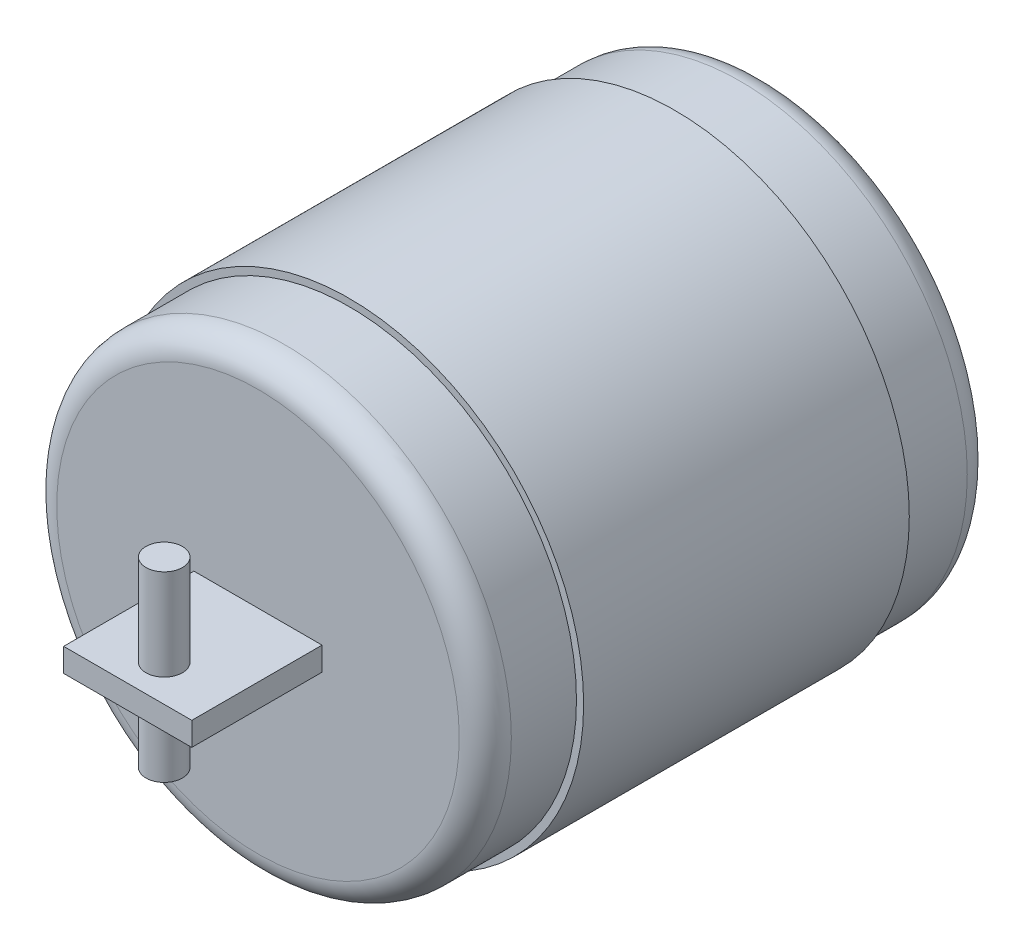
ISO-10303-21;
HEADER;
FILE_DESCRIPTION(('STEP AP214'),'2;1');
FILE_NAME('part.step','',(''),(''),'','','');
FILE_SCHEMA(('AUTOMOTIVE_DESIGN { 1 0 10303 214 1 1 1 1 }'));
ENDSEC;
DATA;
#1=APPLICATION_CONTEXT('core data for automotive mechanical design processes');
#2=APPLICATION_PROTOCOL_DEFINITION('international standard','automotive_design',2000,#1);
#3=PRODUCT_CONTEXT('',#1,'mechanical');
#4=PRODUCT('Part','Part','',(#3));
#5=PRODUCT_RELATED_PRODUCT_CATEGORY('part','',(#4));
#6=PRODUCT_DEFINITION_FORMATION('','',#4);
#7=PRODUCT_DEFINITION_CONTEXT('part definition',#1,'design');
#8=PRODUCT_DEFINITION('design','',#6,#7);
#9=PRODUCT_DEFINITION_SHAPE('','',#8);
#10=(LENGTH_UNIT() NAMED_UNIT(*) SI_UNIT(.MILLI.,.METRE.));
#11=(NAMED_UNIT(*) PLANE_ANGLE_UNIT() SI_UNIT($,.RADIAN.));
#12=(NAMED_UNIT(*) SI_UNIT($,.STERADIAN.) SOLID_ANGLE_UNIT());
#13=UNCERTAINTY_MEASURE_WITH_UNIT(LENGTH_MEASURE(1.E-05),#10,'distance_accuracy_value','');
#14=(GEOMETRIC_REPRESENTATION_CONTEXT(3) GLOBAL_UNCERTAINTY_ASSIGNED_CONTEXT((#13)) GLOBAL_UNIT_ASSIGNED_CONTEXT((#10,
#11,#12)) REPRESENTATION_CONTEXT('',''));
#15=CARTESIAN_POINT('',(0.,0.,0.));
#16=DIRECTION('',(0.,0.,1.));
#17=DIRECTION('',(1.,0.,0.));
#18=AXIS2_PLACEMENT_3D('',#15,#16,#17);
#19=CARTESIAN_POINT('',(0.,0.,25.));
#20=DIRECTION('',(0.,0.,-1.));
#21=DIRECTION('',(-1.,0.,0.));
#22=AXIS2_PLACEMENT_3D('',#19,#20,#21);
#23=CYLINDRICAL_SURFACE('',#22,18.);
#24=CARTESIAN_POINT('',(0.,0.,25.));
#25=DIRECTION('',(0.,0.,1.));
#26=DIRECTION('',(1.,0.,0.));
#27=AXIS2_PLACEMENT_3D('',#24,#25,#26);
#28=CIRCLE('',#27,18.);
#29=CARTESIAN_POINT('',(18.,0.,25.));
#30=VERTEX_POINT('',#29);
#31=EDGE_CURVE('E146',#30,#30,#28,.T.);
#32=ORIENTED_EDGE('',*,*,#31,.F.);
#33=EDGE_LOOP('',(#32));
#34=FACE_BOUND('',#33,.T.);
#35=CARTESIAN_POINT('',(0.,0.,0.));
#36=DIRECTION('',(0.,0.,1.));
#37=DIRECTION('',(1.,0.,0.));
#38=AXIS2_PLACEMENT_3D('',#35,#36,#37);
#39=CIRCLE('',#38,18.);
#40=CARTESIAN_POINT('',(18.,0.,0.));
#41=VERTEX_POINT('',#40);
#42=EDGE_CURVE('E140',#41,#41,#39,.T.);
#43=ORIENTED_EDGE('',*,*,#42,.T.);
#44=EDGE_LOOP('',(#43));
#45=FACE_BOUND('',#44,.T.);
#46=ADVANCED_FACE('F43',(#34,#45),#23,.T.);
#47=CARTESIAN_POINT('',(0.,0.,25.));
#48=DIRECTION('',(0.,0.,1.));
#49=DIRECTION('',(1.,0.,0.));
#50=AXIS2_PLACEMENT_3D('',#47,#48,#49);
#51=PLANE('',#50);
#52=CARTESIAN_POINT('',(0.,0.,25.));
#53=DIRECTION('',(0.,0.,1.));
#54=DIRECTION('',(1.,0.,0.));
#55=AXIS2_PLACEMENT_3D('',#52,#53,#54);
#56=CIRCLE('',#55,17.45);
#57=CARTESIAN_POINT('',(17.45,0.,25.));
#58=VERTEX_POINT('',#57);
#59=EDGE_CURVE('E141',#58,#58,#56,.T.);
#60=ORIENTED_EDGE('',*,*,#59,.F.);
#61=EDGE_LOOP('',(#60));
#62=FACE_BOUND('',#61,.T.);
#63=ORIENTED_EDGE('',*,*,#31,.T.);
#64=EDGE_LOOP('',(#63));
#65=FACE_BOUND('',#64,.T.);
#66=ADVANCED_FACE('F186',(#62,#65),#51,.T.);
#67=CARTESIAN_POINT('',(0.,0.,0.));
#68=DIRECTION('',(0.,0.,1.));
#69=DIRECTION('',(1.,0.,0.));
#70=AXIS2_PLACEMENT_3D('',#67,#68,#69);
#71=PLANE('',#70);
#72=CARTESIAN_POINT('',(0.,0.,0.));
#73=DIRECTION('',(0.,0.,1.));
#74=DIRECTION('',(1.,0.,0.));
#75=AXIS2_PLACEMENT_3D('',#72,#73,#74);
#76=CIRCLE('',#75,17.45);
#77=CARTESIAN_POINT('',(17.45,0.,0.));
#78=VERTEX_POINT('',#77);
#79=EDGE_CURVE('E136',#78,#78,#76,.T.);
#80=ORIENTED_EDGE('',*,*,#79,.T.);
#81=EDGE_LOOP('',(#80));
#82=FACE_BOUND('',#81,.T.);
#83=ORIENTED_EDGE('',*,*,#42,.F.);
#84=EDGE_LOOP('',(#83));
#85=FACE_BOUND('',#84,.T.);
#86=ADVANCED_FACE('F182',(#82,#85),#71,.F.);
#87=CARTESIAN_POINT('',(0.,0.,32.));
#88=DIRECTION('',(0.,0.,-1.));
#89=DIRECTION('',(-1.,0.,0.));
#90=AXIS2_PLACEMENT_3D('',#87,#88,#89);
#91=CYLINDRICAL_SURFACE('',#90,17.45);
#92=CARTESIAN_POINT('',(0.,0.,30.));
#93=DIRECTION('',(0.,0.,1.));
#94=DIRECTION('',(1.,0.,0.));
#95=AXIS2_PLACEMENT_3D('',#92,#93,#94);
#96=CIRCLE('',#95,17.45);
#97=CARTESIAN_POINT('',(17.45,0.,30.));
#98=VERTEX_POINT('',#97);
#99=EDGE_CURVE('E156',#98,#98,#96,.F.);
#100=ORIENTED_EDGE('',*,*,#99,.T.);
#101=EDGE_LOOP('',(#100));
#102=FACE_BOUND('',#101,.T.);
#103=ORIENTED_EDGE('',*,*,#59,.T.);
#104=EDGE_LOOP('',(#103));
#105=FACE_BOUND('',#104,.T.);
#106=ADVANCED_FACE('F185',(#102,#105),#91,.T.);
#107=CARTESIAN_POINT('',(0.,0.,32.));
#108=DIRECTION('',(0.,0.,1.));
#109=DIRECTION('',(1.,0.,0.));
#110=AXIS2_PLACEMENT_3D('',#107,#108,#109);
#111=PLANE('',#110);
#112=DIRECTION('',(0.,-1.,0.));
#113=VECTOR('',#112,1.);
#114=CARTESIAN_POINT('',(4.91823575051056,0.,32.));
#115=LINE('',#114,#113);
#116=CARTESIAN_POINT('',(4.91823575051056,0.900531566575984,32.));
#117=VERTEX_POINT('',#116);
#118=CARTESIAN_POINT('',(4.91823575051056,-0.900531566575984,32.));
#119=VERTEX_POINT('',#118);
#120=EDGE_CURVE('E119',#117,#119,#115,.T.);
#121=ORIENTED_EDGE('',*,*,#120,.T.);
#122=DIRECTION('',(1.,0.,0.));
#123=VECTOR('',#122,1.);
#124=CARTESIAN_POINT('',(0.,-0.900531566575984,32.));
#125=LINE('',#124,#123);
#126=CARTESIAN_POINT('',(-4.91823575051056,-0.900531566575984,32.));
#127=VERTEX_POINT('',#126);
#128=EDGE_CURVE('E114',#127,#119,#125,.T.);
#129=ORIENTED_EDGE('',*,*,#128,.F.);
#130=DIRECTION('',(0.,-1.,0.));
#131=VECTOR('',#130,1.);
#132=CARTESIAN_POINT('',(-4.91823575051056,0.,32.));
#133=LINE('',#132,#131);
#134=CARTESIAN_POINT('',(-4.91823575051056,0.900531566575984,32.));
#135=VERTEX_POINT('',#134);
#136=EDGE_CURVE('E125',#135,#127,#133,.T.);
#137=ORIENTED_EDGE('',*,*,#136,.F.);
#138=DIRECTION('',(1.,0.,0.));
#139=VECTOR('',#138,1.);
#140=CARTESIAN_POINT('',(0.,0.900531566575984,32.));
#141=LINE('',#140,#139);
#142=EDGE_CURVE('E100',#135,#117,#141,.T.);
#143=ORIENTED_EDGE('',*,*,#142,.T.);
#144=EDGE_LOOP('',(#121,#129,#137,#143));
#145=FACE_BOUND('',#144,.T.);
#146=CARTESIAN_POINT('',(0.,0.,32.));
#147=DIRECTION('',(0.,0.,1.));
#148=DIRECTION('',(1.,0.,0.));
#149=AXIS2_PLACEMENT_3D('',#146,#147,#148);
#150=CIRCLE('',#149,15.45);
#151=CARTESIAN_POINT('',(15.45,0.,32.));
#152=VERTEX_POINT('',#151);
#153=EDGE_CURVE('E145',#152,#152,#150,.T.);
#154=ORIENTED_EDGE('',*,*,#153,.T.);
#155=EDGE_LOOP('',(#154));
#156=FACE_BOUND('',#155,.T.);
#157=ADVANCED_FACE('F178',(#145,#156),#111,.T.);
#158=CARTESIAN_POINT('',(0.,0.,-7.));
#159=DIRECTION('',(0.,0.,1.));
#160=DIRECTION('',(1.,0.,0.));
#161=AXIS2_PLACEMENT_3D('',#158,#159,#160);
#162=CYLINDRICAL_SURFACE('',#161,17.45);
#163=CARTESIAN_POINT('',(0.,0.,-5.));
#164=DIRECTION('',(0.,0.,1.));
#165=DIRECTION('',(1.,0.,0.));
#166=AXIS2_PLACEMENT_3D('',#163,#164,#165);
#167=CIRCLE('',#166,17.45);
#168=CARTESIAN_POINT('',(17.45,0.,-5.));
#169=VERTEX_POINT('',#168);
#170=EDGE_CURVE('E160',#169,#169,#167,.T.);
#171=ORIENTED_EDGE('',*,*,#170,.T.);
#172=EDGE_LOOP('',(#171));
#173=FACE_BOUND('',#172,.T.);
#174=ORIENTED_EDGE('',*,*,#79,.F.);
#175=EDGE_LOOP('',(#174));
#176=FACE_BOUND('',#175,.T.);
#177=ADVANCED_FACE('F175',(#173,#176),#162,.T.);
#178=CARTESIAN_POINT('',(0.,0.,-7.));
#179=DIRECTION('',(0.,0.,1.));
#180=DIRECTION('',(1.,0.,0.));
#181=AXIS2_PLACEMENT_3D('',#178,#179,#180);
#182=PLANE('',#181);
#183=CARTESIAN_POINT('',(0.,0.,-7.));
#184=DIRECTION('',(0.,0.,1.));
#185=DIRECTION('',(1.,0.,0.));
#186=AXIS2_PLACEMENT_3D('',#183,#184,#185);
#187=CIRCLE('',#186,15.45);
#188=CARTESIAN_POINT('',(15.45,0.,-7.));
#189=VERTEX_POINT('',#188);
#190=EDGE_CURVE('E53',#189,#189,#187,.F.);
#191=ORIENTED_EDGE('',*,*,#190,.T.);
#192=EDGE_LOOP('',(#191));
#193=FACE_BOUND('',#192,.T.);
#194=ADVANCED_FACE('F167',(#193),#182,.F.);
#195=CARTESIAN_POINT('',(0.,0.,30.));
#196=DIRECTION('',(0.,0.,1.));
#197=DIRECTION('',(1.,0.,0.));
#198=AXIS2_PLACEMENT_3D('',#195,#196,#197);
#199=TOROIDAL_SURFACE('',#198,15.45,2.);
#200=ORIENTED_EDGE('',*,*,#99,.F.);
#201=EDGE_LOOP('',(#200));
#202=FACE_BOUND('',#201,.T.);
#203=ORIENTED_EDGE('',*,*,#153,.F.);
#204=EDGE_LOOP('',(#203));
#205=FACE_BOUND('',#204,.T.);
#206=ADVANCED_FACE('F172',(#202,#205),#199,.T.);
#207=CARTESIAN_POINT('',(0.,0.,-5.));
#208=DIRECTION('',(0.,0.,1.));
#209=DIRECTION('',(1.,0.,0.));
#210=AXIS2_PLACEMENT_3D('',#207,#208,#209);
#211=TOROIDAL_SURFACE('',#210,15.45,2.);
#212=ORIENTED_EDGE('',*,*,#190,.F.);
#213=EDGE_LOOP('',(#212));
#214=FACE_BOUND('',#213,.T.);
#215=ORIENTED_EDGE('',*,*,#170,.F.);
#216=EDGE_LOOP('',(#215));
#217=FACE_BOUND('',#216,.T.);
#218=ADVANCED_FACE('F45',(#214,#217),#211,.T.);
#219=CARTESIAN_POINT('',(4.91823575051056,0.,42.));
#220=DIRECTION('',(1.,0.,0.));
#221=DIRECTION('',(0.,0.,-1.));
#222=AXIS2_PLACEMENT_3D('',#219,#220,#221);
#223=PLANE('',#222);
#224=ORIENTED_EDGE('',*,*,#120,.F.);
#225=DIRECTION('',(0.,0.,-1.));
#226=VECTOR('',#225,1.);
#227=CARTESIAN_POINT('',(4.91823575051056,0.900531566575984,42.));
#228=LINE('',#227,#226);
#229=CARTESIAN_POINT('',(4.91823575051056,0.900531566575984,42.));
#230=VERTEX_POINT('',#229);
#231=EDGE_CURVE('E89',#230,#117,#228,.T.);
#232=ORIENTED_EDGE('',*,*,#231,.F.);
#233=DIRECTION('',(0.,-1.,0.));
#234=VECTOR('',#233,1.);
#235=CARTESIAN_POINT('',(4.91823575051056,0.,42.));
#236=LINE('',#235,#234);
#237=CARTESIAN_POINT('',(4.91823575051056,-0.900531566575984,42.));
#238=VERTEX_POINT('',#237);
#239=EDGE_CURVE('E110',#230,#238,#236,.T.);
#240=ORIENTED_EDGE('',*,*,#239,.T.);
#241=DIRECTION('',(0.,0.,-1.));
#242=VECTOR('',#241,1.);
#243=CARTESIAN_POINT('',(4.91823575051056,-0.900531566575984,42.));
#244=LINE('',#243,#242);
#245=EDGE_CURVE('E86',#238,#119,#244,.T.);
#246=ORIENTED_EDGE('',*,*,#245,.T.);
#247=EDGE_LOOP('',(#224,#232,#240,#246));
#248=FACE_BOUND('',#247,.T.);
#249=ADVANCED_FACE('F171',(#248),#223,.T.);
#250=CARTESIAN_POINT('',(0.,0.900531566575984,42.));
#251=DIRECTION('',(0.,1.,0.));
#252=DIRECTION('',(0.,0.,1.));
#253=AXIS2_PLACEMENT_3D('',#250,#251,#252);
#254=PLANE('',#253);
#255=CARTESIAN_POINT('',(0.,0.900531566575984,39.2));
#256=DIRECTION('',(0.,1.,0.));
#257=DIRECTION('',(0.,0.,1.));
#258=AXIS2_PLACEMENT_3D('',#255,#256,#257);
#259=CIRCLE('',#258,1.4);
#260=CARTESIAN_POINT('',(0.,0.900531566575984,40.6));
#261=VERTEX_POINT('',#260);
#262=EDGE_CURVE('E11',#261,#261,#259,.T.);
#263=ORIENTED_EDGE('',*,*,#262,.F.);
#264=EDGE_LOOP('',(#263));
#265=FACE_BOUND('',#264,.T.);
#266=ORIENTED_EDGE('',*,*,#142,.F.);
#267=DIRECTION('',(0.,0.,-1.));
#268=VECTOR('',#267,1.);
#269=CARTESIAN_POINT('',(-4.91823575051056,0.900531566575984,42.));
#270=LINE('',#269,#268);
#271=CARTESIAN_POINT('',(-4.91823575051056,0.900531566575984,42.));
#272=VERTEX_POINT('',#271);
#273=EDGE_CURVE('E94',#272,#135,#270,.T.);
#274=ORIENTED_EDGE('',*,*,#273,.F.);
#275=DIRECTION('',(1.,0.,0.));
#276=VECTOR('',#275,1.);
#277=CARTESIAN_POINT('',(0.,0.900531566575984,42.));
#278=LINE('',#277,#276);
#279=EDGE_CURVE('E98',#272,#230,#278,.T.);
#280=ORIENTED_EDGE('',*,*,#279,.T.);
#281=ORIENTED_EDGE('',*,*,#231,.T.);
#282=EDGE_LOOP('',(#266,#274,#280,#281));
#283=FACE_BOUND('',#282,.T.);
#284=ADVANCED_FACE('F96',(#265,#283),#254,.T.);
#285=CARTESIAN_POINT('',(-4.91823575051056,0.,42.));
#286=DIRECTION('',(1.,0.,0.));
#287=DIRECTION('',(0.,0.,-1.));
#288=AXIS2_PLACEMENT_3D('',#285,#286,#287);
#289=PLANE('',#288);
#290=ORIENTED_EDGE('',*,*,#136,.T.);
#291=DIRECTION('',(0.,0.,-1.));
#292=VECTOR('',#291,1.);
#293=CARTESIAN_POINT('',(-4.91823575051056,-0.900531566575984,42.));
#294=LINE('',#293,#292);
#295=CARTESIAN_POINT('',(-4.91823575051056,-0.900531566575984,42.));
#296=VERTEX_POINT('',#295);
#297=EDGE_CURVE('E61',#296,#127,#294,.T.);
#298=ORIENTED_EDGE('',*,*,#297,.F.);
#299=DIRECTION('',(0.,-1.,0.));
#300=VECTOR('',#299,1.);
#301=CARTESIAN_POINT('',(-4.91823575051056,0.,42.));
#302=LINE('',#301,#300);
#303=EDGE_CURVE('E105',#272,#296,#302,.T.);
#304=ORIENTED_EDGE('',*,*,#303,.F.);
#305=ORIENTED_EDGE('',*,*,#273,.T.);
#306=EDGE_LOOP('',(#290,#298,#304,#305));
#307=FACE_BOUND('',#306,.T.);
#308=ADVANCED_FACE('F106',(#307),#289,.F.);
#309=CARTESIAN_POINT('',(0.,-0.900531566575984,42.));
#310=DIRECTION('',(0.,1.,0.));
#311=DIRECTION('',(0.,0.,1.));
#312=AXIS2_PLACEMENT_3D('',#309,#310,#311);
#313=PLANE('',#312);
#314=CARTESIAN_POINT('',(0.,-0.900531566575984,39.2));
#315=DIRECTION('',(0.,1.,0.));
#316=DIRECTION('',(0.,0.,1.));
#317=AXIS2_PLACEMENT_3D('',#314,#315,#316);
#318=CIRCLE('',#317,1.4);
#319=CARTESIAN_POINT('',(0.,-0.900531566575984,40.6));
#320=VERTEX_POINT('',#319);
#321=EDGE_CURVE('E47',#320,#320,#318,.T.);
#322=ORIENTED_EDGE('',*,*,#321,.T.);
#323=EDGE_LOOP('',(#322));
#324=FACE_BOUND('',#323,.T.);
#325=ORIENTED_EDGE('',*,*,#128,.T.);
#326=ORIENTED_EDGE('',*,*,#245,.F.);
#327=DIRECTION('',(1.,0.,0.));
#328=VECTOR('',#327,1.);
#329=CARTESIAN_POINT('',(0.,-0.900531566575984,42.));
#330=LINE('',#329,#328);
#331=EDGE_CURVE('E69',#296,#238,#330,.T.);
#332=ORIENTED_EDGE('',*,*,#331,.F.);
#333=ORIENTED_EDGE('',*,*,#297,.T.);
#334=EDGE_LOOP('',(#325,#326,#332,#333));
#335=FACE_BOUND('',#334,.T.);
#336=ADVANCED_FACE('F228',(#324,#335),#313,.F.);
#337=CARTESIAN_POINT('',(0.,0.,42.));
#338=DIRECTION('',(0.,0.,1.));
#339=DIRECTION('',(1.,0.,0.));
#340=AXIS2_PLACEMENT_3D('',#337,#338,#339);
#341=PLANE('',#340);
#342=ORIENTED_EDGE('',*,*,#239,.F.);
#343=ORIENTED_EDGE('',*,*,#279,.F.);
#344=ORIENTED_EDGE('',*,*,#303,.T.);
#345=ORIENTED_EDGE('',*,*,#331,.T.);
#346=EDGE_LOOP('',(#342,#343,#344,#345));
#347=FACE_BOUND('',#346,.T.);
#348=ADVANCED_FACE('F109',(#347),#341,.T.);
#349=CARTESIAN_POINT('',(0.,-6.09946843342402,39.2));
#350=DIRECTION('',(0.,1.,0.));
#351=DIRECTION('',(0.,0.,1.));
#352=AXIS2_PLACEMENT_3D('',#349,#350,#351);
#353=PLANE('',#352);
#354=CARTESIAN_POINT('',(0.,-6.09946843342402,39.2));
#355=DIRECTION('',(0.,1.,0.));
#356=DIRECTION('',(0.,0.,1.));
#357=AXIS2_PLACEMENT_3D('',#354,#355,#356);
#358=CIRCLE('',#357,1.4);
#359=CARTESIAN_POINT('',(0.,-6.09946843342402,40.6));
#360=VERTEX_POINT('',#359);
#361=EDGE_CURVE('E253',#360,#360,#358,.T.);
#362=ORIENTED_EDGE('',*,*,#361,.F.);
#363=EDGE_LOOP('',(#362));
#364=FACE_BOUND('',#363,.T.);
#365=ADVANCED_FACE('F234',(#364),#353,.F.);
#366=CARTESIAN_POINT('',(0.,-6.09946843342402,39.2));
#367=DIRECTION('',(0.,1.,0.));
#368=DIRECTION('',(0.,0.,1.));
#369=AXIS2_PLACEMENT_3D('',#366,#367,#368);
#370=CYLINDRICAL_SURFACE('',#369,1.4);
#371=ORIENTED_EDGE('',*,*,#361,.T.);
#372=EDGE_LOOP('',(#371));
#373=FACE_BOUND('',#372,.T.);
#374=ORIENTED_EDGE('',*,*,#321,.F.);
#375=EDGE_LOOP('',(#374));
#376=FACE_BOUND('',#375,.T.);
#377=ADVANCED_FACE('F239',(#373,#376),#370,.T.);
#378=ORIENTED_EDGE('',*,*,#262,.T.);
#379=EDGE_LOOP('',(#378));
#380=FACE_BOUND('',#379,.T.);
#381=CARTESIAN_POINT('',(0.,7.90053156657598,39.2));
#382=DIRECTION('',(0.,1.,0.));
#383=DIRECTION('',(0.,0.,1.));
#384=AXIS2_PLACEMENT_3D('',#381,#382,#383);
#385=CIRCLE('',#384,1.4);
#386=CARTESIAN_POINT('',(0.,7.90053156657598,40.6));
#387=VERTEX_POINT('',#386);
#388=EDGE_CURVE('E250',#387,#387,#385,.T.);
#389=ORIENTED_EDGE('',*,*,#388,.F.);
#390=EDGE_LOOP('',(#389));
#391=FACE_BOUND('',#390,.T.);
#392=ADVANCED_FACE('F235',(#380,#391),#370,.T.);
#393=CARTESIAN_POINT('',(0.,7.90053156657598,39.2));
#394=DIRECTION('',(0.,1.,0.));
#395=DIRECTION('',(0.,0.,1.));
#396=AXIS2_PLACEMENT_3D('',#393,#394,#395);
#397=PLANE('',#396);
#398=ORIENTED_EDGE('',*,*,#388,.T.);
#399=EDGE_LOOP('',(#398));
#400=FACE_BOUND('',#399,.T.);
#401=ADVANCED_FACE('F238',(#400),#397,.T.);
#402=CLOSED_SHELL('',(#46,#66,#86,#106,#157,#177,#194,#206,#218,#249,#284,#308,#336,#348,#365,
#377,#392,#401));
#403=MANIFOLD_SOLID_BREP('B2',#402);
#404=ADVANCED_BREP_SHAPE_REPRESENTATION('',(#18,#403),#14);
#405=SHAPE_DEFINITION_REPRESENTATION(#9,#404);
ENDSEC;
END-ISO-10303-21;
